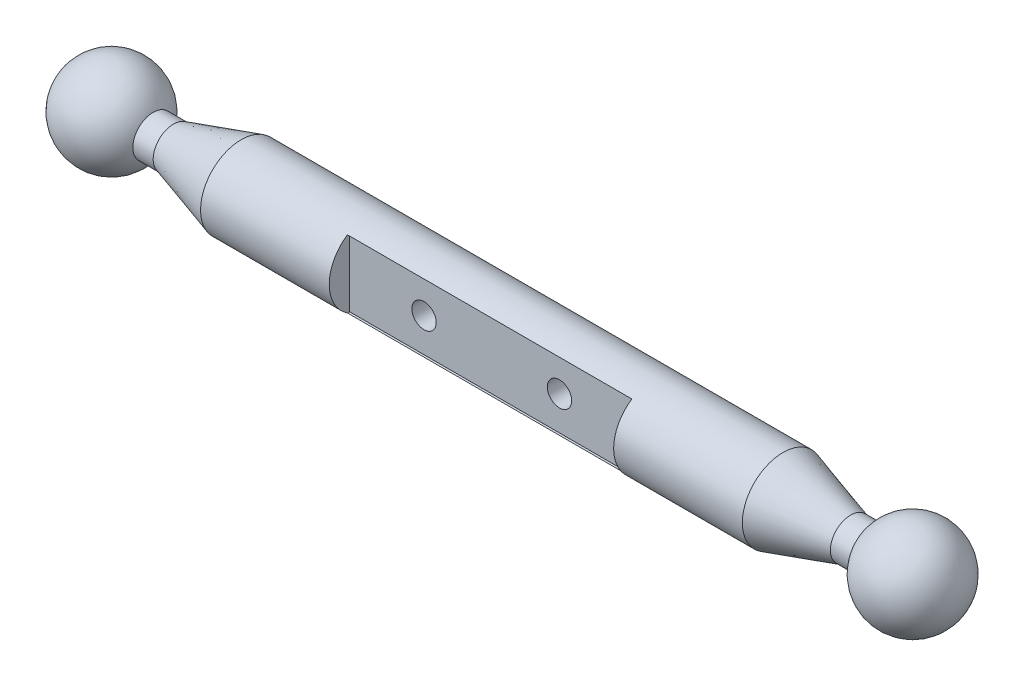
ISO-10303-21;
HEADER;
FILE_DESCRIPTION(('STEP AP214'),'2;1');
FILE_NAME('part.step','',(''),(''),'','','');
FILE_SCHEMA(('AUTOMOTIVE_DESIGN { 1 0 10303 214 1 1 1 1 }'));
ENDSEC;
DATA;
#1=APPLICATION_CONTEXT('core data for automotive mechanical design processes');
#2=APPLICATION_PROTOCOL_DEFINITION('international standard','automotive_design',2000,#1);
#3=PRODUCT_CONTEXT('',#1,'mechanical');
#4=PRODUCT('Part','Part','',(#3));
#5=PRODUCT_RELATED_PRODUCT_CATEGORY('part','',(#4));
#6=PRODUCT_DEFINITION_FORMATION('','',#4);
#7=PRODUCT_DEFINITION_CONTEXT('part definition',#1,'design');
#8=PRODUCT_DEFINITION('design','',#6,#7);
#9=PRODUCT_DEFINITION_SHAPE('','',#8);
#10=(LENGTH_UNIT() NAMED_UNIT(*) SI_UNIT(.MILLI.,.METRE.));
#11=(NAMED_UNIT(*) PLANE_ANGLE_UNIT() SI_UNIT($,.RADIAN.));
#12=(NAMED_UNIT(*) SI_UNIT($,.STERADIAN.) SOLID_ANGLE_UNIT());
#13=UNCERTAINTY_MEASURE_WITH_UNIT(LENGTH_MEASURE(1.E-05),#10,'distance_accuracy_value','');
#14=(GEOMETRIC_REPRESENTATION_CONTEXT(3) GLOBAL_UNCERTAINTY_ASSIGNED_CONTEXT((#13)) GLOBAL_UNIT_ASSIGNED_CONTEXT((#10,
#11,#12)) REPRESENTATION_CONTEXT('',''));
#15=CARTESIAN_POINT('',(0.,0.,0.));
#16=DIRECTION('',(0.,0.,1.));
#17=DIRECTION('',(1.,0.,0.));
#18=AXIS2_PLACEMENT_3D('',#15,#16,#17);
#19=CARTESIAN_POINT('',(295.769230769231,0.,0.));
#20=DIRECTION('',(0.,0.,1.));
#21=DIRECTION('',(1.,0.,0.));
#22=AXIS2_PLACEMENT_3D('',#19,#20,#21);
#23=SPHERICAL_SURFACE('',#22,34.2307692307692);
#24=CARTESIAN_POINT('',(295.769230769231,0.,0.));
#25=DIRECTION('',(-1.,0.,0.));
#26=DIRECTION('',(0.,0.,1.));
#27=AXIS2_PLACEMENT_3D('',#24,#25,#26);
#28=SPHERICAL_SURFACE('',#27,34.2307692307692);
#29=CARTESIAN_POINT('',(265.,0.,0.));
#30=DIRECTION('',(-1.,0.,0.));
#31=DIRECTION('',(0.,0.,1.));
#32=AXIS2_PLACEMENT_3D('',#29,#30,#31);
#33=CIRCLE('',#32,15.);
#34=CARTESIAN_POINT('',(265.,0.,15.));
#35=VERTEX_POINT('',#34);
#36=EDGE_CURVE('E147',#35,#35,#33,.T.);
#37=ORIENTED_EDGE('',*,*,#36,.F.);
#38=EDGE_LOOP('',(#37));
#39=FACE_BOUND('',#38,.T.);
#40=ADVANCED_FACE('F39',(#39),#28,.T.);
#41=CARTESIAN_POINT('',(-265.,0.,0.));
#42=DIRECTION('',(-1.,0.,0.));
#43=DIRECTION('',(0.,0.,1.));
#44=AXIS2_PLACEMENT_3D('',#41,#42,#43);
#45=CYLINDRICAL_SURFACE('',#44,15.);
#46=CARTESIAN_POINT('',(250.,0.,0.));
#47=DIRECTION('',(-1.,0.,0.));
#48=DIRECTION('',(0.,0.,1.));
#49=AXIS2_PLACEMENT_3D('',#46,#47,#48);
#50=CIRCLE('',#49,15.);
#51=CARTESIAN_POINT('',(250.,0.,15.));
#52=VERTEX_POINT('',#51);
#53=EDGE_CURVE('E143',#52,#52,#50,.T.);
#54=ORIENTED_EDGE('',*,*,#53,.F.);
#55=EDGE_LOOP('',(#54));
#56=FACE_BOUND('',#55,.T.);
#57=ORIENTED_EDGE('',*,*,#36,.T.);
#58=EDGE_LOOP('',(#57));
#59=FACE_BOUND('',#58,.T.);
#60=ADVANCED_FACE('F166',(#56,#59),#45,.T.);
#61=CARTESIAN_POINT('',(250.,0.,0.));
#62=DIRECTION('',(-1.,0.,0.));
#63=DIRECTION('',(0.,0.,1.));
#64=AXIS2_PLACEMENT_3D('',#61,#62,#63);
#65=CONICAL_SURFACE('',#64,15.,0.291456794477867);
#66=CARTESIAN_POINT('',(200.,0.,0.));
#67=DIRECTION('',(-1.,0.,0.));
#68=DIRECTION('',(0.,0.,1.));
#69=AXIS2_PLACEMENT_3D('',#66,#67,#68);
#70=CIRCLE('',#69,30.);
#71=CARTESIAN_POINT('',(200.,0.,30.));
#72=VERTEX_POINT('',#71);
#73=EDGE_CURVE('E139',#72,#72,#70,.T.);
#74=ORIENTED_EDGE('',*,*,#73,.F.);
#75=EDGE_LOOP('',(#74));
#76=FACE_BOUND('',#75,.T.);
#77=ORIENTED_EDGE('',*,*,#53,.T.);
#78=EDGE_LOOP('',(#77));
#79=FACE_BOUND('',#78,.T.);
#80=ADVANCED_FACE('F172',(#76,#79),#65,.T.);
#81=CARTESIAN_POINT('',(-265.,0.,0.));
#82=DIRECTION('',(-1.,0.,0.));
#83=DIRECTION('',(0.,0.,1.));
#84=AXIS2_PLACEMENT_3D('',#81,#82,#83);
#85=CYLINDRICAL_SURFACE('',#84,30.);
#86=CARTESIAN_POINT('',(59.,0.,-30.));
#87=CARTESIAN_POINT('',(58.9999995192663,0.24687522719446,-29.9999996908044));
#88=CARTESIAN_POINT('',(58.9898337374895,0.493758933697373,-29.9969453762635));
#89=CARTESIAN_POINT('',(58.949262166763,0.985713316335449,-29.984811532503));
#90=CARTESIAN_POINT('',(58.9188554543427,1.23078390923342,-29.975731728377));
#91=CARTESIAN_POINT('',(58.8380745653432,1.71734028727223,-29.9517958675245));
#92=CARTESIAN_POINT('',(58.7876990206355,1.95882582561324,-29.9369394150227));
#93=CARTESIAN_POINT('',(58.6674006880664,2.43656882894963,-29.9018482217892));
#94=CARTESIAN_POINT('',(58.5974706692544,2.67282432501112,-29.8816114916483));
#95=CARTESIAN_POINT('',(58.438809233375,3.13795593973208,-29.836349231097));
#96=CARTESIAN_POINT('',(58.3501134504766,3.36684511034698,-29.8113327854601));
#97=CARTESIAN_POINT('',(58.1545090861489,3.81629034248756,-29.7571367691595));
#98=CARTESIAN_POINT('',(58.0475936578816,4.03684323307769,-29.7279556341019));
#99=CARTESIAN_POINT('',(57.8164081053077,4.46806405999108,-29.6662069742973));
#100=CARTESIAN_POINT('',(57.6921435122813,4.67873511836349,-29.6336405297005));
#101=CARTESIAN_POINT('',(57.4270444928224,5.08907702569748,-29.5659358702645));
#102=CARTESIAN_POINT('',(57.2862024720026,5.28874277096538,-29.5307964795248));
#103=CARTESIAN_POINT('',(56.9850746947394,5.68079175811244,-29.4579256487591));
#104=CARTESIAN_POINT('',(56.8243802933719,5.872853126084,-29.4201506763858));
#105=CARTESIAN_POINT('',(56.487708747399,6.24276841718319,-29.3438835164778));
#106=CARTESIAN_POINT('',(56.3117380552037,6.42062827839696,-29.3053916370948));
#107=CARTESIAN_POINT('',(55.945464276371,6.76121495469285,-29.2286925276642));
#108=CARTESIAN_POINT('',(55.7551530973834,6.92393310779205,-29.1904854719092));
#109=CARTESIAN_POINT('',(55.3615437764351,7.23301044029677,-29.1154400363661));
#110=CARTESIAN_POINT('',(55.1582504904821,7.37937568089397,-29.0786011528688));
#111=CARTESIAN_POINT('',(54.7350688557075,7.65798662555216,-29.0064894118543));
#112=CARTESIAN_POINT('',(54.5149067756757,7.78983133985888,-28.9712718751733));
#113=CARTESIAN_POINT('',(54.0637917659879,8.03438843056109,-28.904405819866));
#114=CARTESIAN_POINT('',(53.8328431019744,8.14710828969498,-28.8727559070153));
#115=CARTESIAN_POINT('',(53.3616530704563,8.35256518661361,-28.813991056005));
#116=CARTESIAN_POINT('',(53.1214115343119,8.44530186155834,-28.7868762001916));
#117=CARTESIAN_POINT('',(52.6333685232178,8.6099761042191,-28.7380531219073));
#118=CARTESIAN_POINT('',(52.385567317914,8.68191441283537,-28.7163447068465));
#119=CARTESIAN_POINT('',(51.8912849497748,8.80260979417984,-28.6795734086749));
#120=CARTESIAN_POINT('',(51.6449610085294,8.85195939944504,-28.6643415104473));
#121=CARTESIAN_POINT('',(51.148746350119,8.92991899386314,-28.640150467133));
#122=CARTESIAN_POINT('',(50.8988556940309,8.958529337725,-28.6311912147636));
#123=CARTESIAN_POINT('',(50.3974601118256,8.99473123894795,-28.6198387730488));
#124=CARTESIAN_POINT('',(50.1459555362636,9.00232721556963,-28.6174442031708));
#125=CARTESIAN_POINT('',(49.6432208051892,8.99643811389518,-28.6192961531867));
#126=CARTESIAN_POINT('',(49.3919906438751,8.98295349026987,-28.6235425298472));
#127=CARTESIAN_POINT('',(48.9008336962155,8.93590903357945,-28.6382629553569));
#128=CARTESIAN_POINT('',(48.6608279108469,8.90309651768086,-28.6485050902031));
#129=CARTESIAN_POINT('',(48.1844591098566,8.81829693839762,-28.6747206911967));
#130=CARTESIAN_POINT('',(47.9480974234905,8.76630304292881,-28.6906961994197));
#131=CARTESIAN_POINT('',(47.480749416572,8.6435952562788,-28.7279021918085));
#132=CARTESIAN_POINT('',(47.2497623430503,8.57288400473931,-28.7491319349609));
#133=CARTESIAN_POINT('',(46.7946269550669,8.41330748035027,-28.7962353750528));
#134=CARTESIAN_POINT('',(46.5704790190655,8.32444120493493,-28.8221093284476));
#135=CARTESIAN_POINT('',(46.1274335831283,8.12789997921523,-28.8781547204273));
#136=CARTESIAN_POINT('',(45.9086494300025,8.01998497142832,-28.9083799717915));
#137=CARTESIAN_POINT('',(45.4809076890941,7.78698416863509,-28.9720115836062));
#138=CARTESIAN_POINT('',(45.2719503704906,7.66189790363685,-29.0054180311211));
#139=CARTESIAN_POINT('',(44.8650752115418,7.39538391059138,-29.074511931035));
#140=CARTESIAN_POINT('',(44.6671594659432,7.25395309727254,-29.1101998135182));
#141=CARTESIAN_POINT('',(44.2835659462495,6.95567501480213,-29.182908431969));
#142=CARTESIAN_POINT('',(44.0978885236212,6.79882730322163,-29.2199292061682));
#143=CARTESIAN_POINT('',(43.7323708740783,6.46380880146506,-29.2959022608772));
#144=CARTESIAN_POINT('',(43.5530992991263,6.28502066721602,-29.3348705814157));
#145=CARTESIAN_POINT('',(43.2101847118692,5.91290332936832,-29.4121348756642));
#146=CARTESIAN_POINT('',(43.0465417554301,5.71957407379525,-29.4504308469705));
#147=CARTESIAN_POINT('',(42.7359658901512,5.3195794785746,-29.5253022037011));
#148=CARTESIAN_POINT('',(42.5890347056456,5.1129127661993,-29.5618774113479));
#149=CARTESIAN_POINT('',(42.3129502622598,4.6875944702094,-29.6322950882592));
#150=CARTESIAN_POINT('',(42.183796239992,4.46894340179161,-29.6661376748422));
#151=CARTESIAN_POINT('',(41.9433966998228,4.01951930468406,-29.7303774016382));
#152=CARTESIAN_POINT('',(41.8322823535362,3.78867237370753,-29.7607488680959));
#153=CARTESIAN_POINT('',(41.630010572923,3.31796148225631,-29.8168958927951));
#154=CARTESIAN_POINT('',(41.5388450621314,3.0781012171682,-29.8426733101916));
#155=CARTESIAN_POINT('',(41.3772087277255,2.59100646332482,-29.8889030810171));
#156=CARTESIAN_POINT('',(41.3067375067721,2.3437721162555,-29.9093555366869));
#157=CARTESIAN_POINT('',(41.1871386385981,1.8437841623914,-29.9443358483416));
#158=CARTESIAN_POINT('',(41.138010211948,1.59103075750433,-29.9588639206812));
#159=CARTESIAN_POINT('',(41.0629386125718,1.09110687447903,-29.9811579409966));
#160=CARTESIAN_POINT('',(41.0362265876865,0.844061604560796,-29.9891478725817));
#161=CARTESIAN_POINT('',(41.0033217346765,0.348488409261127,-29.9989994939179));
#162=CARTESIAN_POINT('',(40.9971284152396,0.0999605195231696,-30.0008613304037));
#163=CARTESIAN_POINT('',(41.0053176037025,-0.396693900528408,-29.9984049092855));
#164=CARTESIAN_POINT('',(41.0196976281217,-0.644820475666569,-29.9940873976123));
#165=CARTESIAN_POINT('',(41.0688954108604,-1.13885569360232,-29.9793942365501));
#166=CARTESIAN_POINT('',(41.1037130246237,-1.38476435207485,-29.9690186300104));
#167=CARTESIAN_POINT('',(41.1924421677717,-1.86699068629301,-29.9428009027874));
#168=CARTESIAN_POINT('',(41.2458998796666,-2.10339917366125,-29.9270889204468));
#169=CARTESIAN_POINT('',(41.3715984982906,-2.5708534262223,-29.8905620083731));
#170=CARTESIAN_POINT('',(41.4438461357044,-2.80189723737997,-29.8697452502259));
#171=CARTESIAN_POINT('',(41.6065108844607,-3.25694777313325,-29.8235575330009));
#172=CARTESIAN_POINT('',(41.6969228196916,-3.4809564814769,-29.7981878715411));
#173=CARTESIAN_POINT('',(41.8952780246177,-3.9206735334169,-29.7435275314969));
#174=CARTESIAN_POINT('',(42.0032280138338,-4.13637865624372,-29.7142353507995));
#175=CARTESIAN_POINT('',(42.2385066958226,-4.5628802169055,-29.6517727567512));
#176=CARTESIAN_POINT('',(42.3662198675666,-4.77345386566451,-29.6185293648857));
#177=CARTESIAN_POINT('',(42.6383113504956,-5.18324820003159,-29.5495708580577));
#178=CARTESIAN_POINT('',(42.7826971389585,-5.38246373149598,-29.513854636987));
#179=CARTESIAN_POINT('',(43.0871309032109,-5.76824209562065,-29.4408886800085));
#180=CARTESIAN_POINT('',(43.2471788632501,-5.95480494100446,-29.4036389456429));
#181=CARTESIAN_POINT('',(43.5819283548985,-6.31416336644097,-29.3285704174924));
#182=CARTESIAN_POINT('',(43.7566301686524,-6.48695868128923,-29.2907516127623));
#183=CARTESIAN_POINT('',(44.1262666482755,-6.82378475322264,-29.2141554298413));
#184=CARTESIAN_POINT('',(44.3217075440941,-6.98726403029261,-29.1753935631618));
#185=CARTESIAN_POINT('',(44.7258613805791,-7.29714192683923,-29.0994358784767));
#186=CARTESIAN_POINT('',(44.9345694569448,-7.44354675134785,-29.0622394947188));
#187=CARTESIAN_POINT('',(45.3640652823454,-7.71836315758024,-28.9904649037997));
#188=CARTESIAN_POINT('',(45.5848577579616,-7.84676762786344,-28.9558877338828));
#189=CARTESIAN_POINT('',(46.0368992630623,-8.08449235365032,-28.8904168620313));
#190=CARTESIAN_POINT('',(46.2681439308399,-8.19382047882574,-28.8595216428362));
#191=CARTESIAN_POINT('',(46.7385371926035,-8.39212213615004,-28.8024806438489));
#192=CARTESIAN_POINT('',(46.9776457057981,-8.48118472093345,-28.7763141931856));
#193=CARTESIAN_POINT('',(47.4630518161847,-8.63880815166785,-28.7293885157136));
#194=CARTESIAN_POINT('',(47.7093494180245,-8.70736898436385,-28.7086292924009));
#195=CARTESIAN_POINT('',(48.2072347226163,-8.82333878587885,-28.6731995828697));
#196=CARTESIAN_POINT('',(48.4588208847163,-8.8707538278203,-28.6585273485378));
#197=CARTESIAN_POINT('',(48.965407725818,-8.94399853503101,-28.6357533281231));
#198=CARTESIAN_POINT('',(49.2204082743396,-8.96982902277118,-28.6276512916859));
#199=CARTESIAN_POINT('',(49.7211344613679,-8.99902686177177,-28.6184858636405));
#200=CARTESIAN_POINT('',(49.9668034039827,-9.00328608012112,-28.6171430269501));
#201=CARTESIAN_POINT('',(50.4576155661757,-8.99170957250374,-28.6207826121306));
#202=CARTESIAN_POINT('',(50.7027588009065,-8.97587443373627,-28.6257648491696));
#203=CARTESIAN_POINT('',(51.1907161868287,-8.92425831634993,-28.6418983433307));
#204=CARTESIAN_POINT('',(51.4335304432754,-8.88847824348013,-28.6530493203148));
#205=CARTESIAN_POINT('',(51.9151010621588,-8.79729759590077,-28.6811754757235));
#206=CARTESIAN_POINT('',(52.1538574057496,-8.74189693009455,-28.6981506811894));
#207=CARTESIAN_POINT('',(52.6226633672994,-8.61278136684696,-28.7371619944993));
#208=CARTESIAN_POINT('',(52.8527849278569,-8.53930707566764,-28.7591313471678));
#209=CARTESIAN_POINT('',(53.3060392714114,-8.37426393967972,-28.8076222134893));
#210=CARTESIAN_POINT('',(53.5291695207128,-8.28268862083897,-28.8341453554081));
#211=CARTESIAN_POINT('',(53.9669532836628,-8.08215610506225,-28.890995244476));
#212=CARTESIAN_POINT('',(54.1816072512342,-7.97319984049175,-28.9213217875808));
#213=CARTESIAN_POINT('',(54.6011787310789,-7.73866416062295,-28.9849587838462));
#214=CARTESIAN_POINT('',(54.8060956621976,-7.6130837548026,-29.0182694147705));
#215=CARTESIAN_POINT('',(55.2122641594683,-7.34126486815789,-29.088248997366));
#216=CARTESIAN_POINT('',(55.4131104100508,-7.19444058113146,-29.1249960762039));
#217=CARTESIAN_POINT('',(55.8018281874227,-6.8848048622528,-29.1997400804732));
#218=CARTESIAN_POINT('',(55.9896994403252,-6.72199309309909,-29.237737032263));
#219=CARTESIAN_POINT('',(56.3513603937697,-6.38137449598392,-29.3139645469731));
#220=CARTESIAN_POINT('',(56.5251464817687,-6.20356384484473,-29.3521951671376));
#221=CARTESIAN_POINT('',(56.8574895356109,-5.83408763816121,-29.4278605216548));
#222=CARTESIAN_POINT('',(57.0160467690642,-5.64242232618264,-29.465295269984));
#223=CARTESIAN_POINT('',(57.3213452270685,-5.24055724419364,-29.5394569988147));
#224=CARTESIAN_POINT('',(57.467599777415,-5.02997746430739,-29.5761305063874));
#225=CARTESIAN_POINT('',(57.741757225868,-4.59683195296546,-29.6465386369227));
#226=CARTESIAN_POINT('',(57.8696667799763,-4.37427060922233,-29.6802743240427));
#227=CARTESIAN_POINT('',(58.1061800827397,-3.91863702485826,-29.7438595202232));
#228=CARTESIAN_POINT('',(58.2147876911611,-3.68556689736799,-29.7737098059185));
#229=CARTESIAN_POINT('',(58.4118183203768,-3.21051695796146,-29.8286729271997));
#230=CARTESIAN_POINT('',(58.5002432889756,-2.96853800844563,-29.853786219907));
#231=CARTESIAN_POINT('',(58.6477609044286,-2.50382115734949,-29.8961424947304));
#232=CARTESIAN_POINT('',(58.708983724957,-2.28180743967458,-29.9139410348257));
#233=CARTESIAN_POINT('',(58.8143018841147,-1.83334279623096,-29.9447721031423));
#234=CARTESIAN_POINT('',(58.8583916635245,-1.60689045524054,-29.9578030843364));
#235=CARTESIAN_POINT('',(58.9290665485835,-1.15106718653289,-29.97877731236));
#236=CARTESIAN_POINT('',(58.9556540259619,-0.921696658553536,-29.9867212485287));
#237=CARTESIAN_POINT('',(58.9911178490915,-0.461552874118431,-29.9973318050471));
#238=CARTESIAN_POINT('',(59.0000004493921,-0.230780141923343,-30.0000002890375));
#239=CARTESIAN_POINT('',(59.,0.,-30.));
#240=B_SPLINE_CURVE_WITH_KNOTS('',3,(#86,#87,#88,#89,#90,#91,#92,#93,#94,#95,#96,#97,#98,#99,
#100,#101,#102,#103,#104,#105,#106,#107,#108,#109,#110,#111,#112,#113,#114,#115,#116,#117,#118,
#119,#120,#121,#122,#123,#124,#125,#126,#127,#128,#129,#130,#131,#132,#133,#134,#135,#136,#137,
#138,#139,#140,#141,#142,#143,#144,#145,#146,#147,#148,#149,#150,#151,#152,#153,#154,#155,#156,
#157,#158,#159,#160,#161,#162,#163,#164,#165,#166,#167,#168,#169,#170,#171,#172,#173,#174,#175,
#176,#177,#178,#179,#180,#181,#182,#183,#184,#185,#186,#187,#188,#189,#190,#191,#192,#193,#194,
#195,#196,#197,#198,#199,#200,#201,#202,#203,#204,#205,#206,#207,#208,#209,#210,#211,#212,#213,
#214,#215,#216,#217,#218,#219,#220,#221,#222,#223,#224,#225,#226,#227,#228,#229,#230,#231,#232,
#233,#234,#235,#236,#237,#238,#239),.UNSPECIFIED.,.T.,.F.,(4,2,2,2,2,2,2,2,2,2,2,2,2,2,2,2,2,2,
2,2,2,2,2,2,2,2,2,2,2,2,2,2,2,2,2,2,2,2,2,2,2,2,2,2,2,2,2,2,2,2,2,2,2,2,2,2,2,2,2,2,2,2,2,2,2,2,
2,2,2,2,2,2,2,2,2,2,4),(0.,0.740413216901877,1.4808602166743,2.22135795560235,2.96212988240107,
3.70150758898388,4.44116376467172,5.18058465858264,5.92034562132777,6.6792378099229,
7.4378110023569,8.1968155110857,8.95553775562748,9.73166741230635,10.507492698835,
11.2833320710434,12.0591438021185,12.8132385740861,13.5673204482712,14.3212437291631,
15.0751507495034,15.8016616365828,16.5284315448307,17.2550990138762,17.9818066221682,
18.7184283271017,19.4550701980193,20.1918513486502,20.9286536493539,21.6962623628207,
22.4638738200863,23.2315644084216,23.9992220202666,24.7722331237349,25.5449306852944,
26.3176134097618,27.0902679138193,27.8351912450429,28.5800967392512,29.32491232089,
30.0697226344752,30.797537709847,31.5256138536762,32.2534828179172,32.9816313180365,
33.7263192489374,34.4713424616101,35.2163649250774,35.9614017364707,36.7336800097588,
37.5056767488154,38.2779776279686,39.0499591483442,39.8184798678771,40.5870010842807,
41.3553014371578,42.1235725129188,42.8598040112379,43.5960139958236,44.3321905500059,
45.0683705222341,45.7952353579564,46.5223606368482,47.2494469236927,47.9765765522916,
48.7301889381115,49.483817226949,50.2376381976291,50.9914459193129,51.7674951526374,
52.5432621006114,53.3188737452505,54.0944105047804,54.7866663836971,55.4791466941858,
56.1715331476467,56.8636749604174),.UNSPECIFIED.);
#241=CARTESIAN_POINT('',(59.,0.,-30.));
#242=VERTEX_POINT('',#241);
#243=EDGE_CURVE('E106',#242,#242,#240,.T.);
#244=ORIENTED_EDGE('',*,*,#243,.T.);
#245=EDGE_LOOP('',(#244));
#246=FACE_BOUND('',#245,.T.);
#247=CARTESIAN_POINT('',(-41.,0.,-30.));
#248=CARTESIAN_POINT('',(-41.0000004807337,0.24687522719446,-29.9999996908044));
#249=CARTESIAN_POINT('',(-41.0101662625105,0.493758933697374,-29.9969453762635));
#250=CARTESIAN_POINT('',(-41.050737833237,0.98571331633545,-29.984811532503));
#251=CARTESIAN_POINT('',(-41.0811445456573,1.23078390923342,-29.975731728377));
#252=CARTESIAN_POINT('',(-41.1619254346568,1.71734028727224,-29.9517958675245));
#253=CARTESIAN_POINT('',(-41.2123009793645,1.95882582561324,-29.9369394150227));
#254=CARTESIAN_POINT('',(-41.3325993119336,2.43656882894963,-29.9018482217893));
#255=CARTESIAN_POINT('',(-41.4025293307456,2.67282432501112,-29.8816114916483));
#256=CARTESIAN_POINT('',(-41.561190766625,3.13795593973208,-29.836349231097));
#257=CARTESIAN_POINT('',(-41.6498865495234,3.36684511034698,-29.8113327854601));
#258=CARTESIAN_POINT('',(-41.8454909138511,3.81629034248756,-29.7571367691595));
#259=CARTESIAN_POINT('',(-41.9524063421184,4.0368432330777,-29.7279556341019));
#260=CARTESIAN_POINT('',(-42.1835918946923,4.46806405999109,-29.6662069742973));
#261=CARTESIAN_POINT('',(-42.3078564877187,4.6787351183635,-29.6336405297005));
#262=CARTESIAN_POINT('',(-42.5729555071776,5.08907702569748,-29.5659358702645));
#263=CARTESIAN_POINT('',(-42.7137975279974,5.28874277096538,-29.5307964795248));
#264=CARTESIAN_POINT('',(-43.0149253052606,5.68079175811244,-29.4579256487591));
#265=CARTESIAN_POINT('',(-43.1756197066281,5.872853126084,-29.4201506763858));
#266=CARTESIAN_POINT('',(-43.512291252601,6.2427684171832,-29.3438835164778));
#267=CARTESIAN_POINT('',(-43.6882619447963,6.42062827839697,-29.3053916370948));
#268=CARTESIAN_POINT('',(-44.054535723629,6.76121495469286,-29.2286925276642));
#269=CARTESIAN_POINT('',(-44.2448469026166,6.92393310779205,-29.1904854719092));
#270=CARTESIAN_POINT('',(-44.6384562235649,7.23301044029677,-29.1154400363661));
#271=CARTESIAN_POINT('',(-44.8417495095179,7.37937568089397,-29.0786011528688));
#272=CARTESIAN_POINT('',(-45.2649311442925,7.65798662555216,-29.0064894118543));
#273=CARTESIAN_POINT('',(-45.4850932243243,7.78983133985888,-28.9712718751733));
#274=CARTESIAN_POINT('',(-45.9362082340121,8.03438843056109,-28.904405819866));
#275=CARTESIAN_POINT('',(-46.1671568980256,8.14710828969498,-28.8727559070153));
#276=CARTESIAN_POINT('',(-46.6383469295437,8.35256518661361,-28.813991056005));
#277=CARTESIAN_POINT('',(-46.8785884656881,8.44530186155834,-28.7868762001916));
#278=CARTESIAN_POINT('',(-47.3666314767822,8.6099761042191,-28.7380531219073));
#279=CARTESIAN_POINT('',(-47.614432682086,8.68191441283537,-28.7163447068465));
#280=CARTESIAN_POINT('',(-48.1087150502252,8.80260979417984,-28.6795734086749));
#281=CARTESIAN_POINT('',(-48.3550389914706,8.85195939944505,-28.6643415104473));
#282=CARTESIAN_POINT('',(-48.851253649881,8.92991899386314,-28.640150467133));
#283=CARTESIAN_POINT('',(-49.1011443059691,8.958529337725,-28.6311912147636));
#284=CARTESIAN_POINT('',(-49.6025398881744,8.99473123894795,-28.6198387730488));
#285=CARTESIAN_POINT('',(-49.8540444637364,9.00232721556963,-28.6174442031708));
#286=CARTESIAN_POINT('',(-50.3567791948108,8.99643811389518,-28.6192961531867));
#287=CARTESIAN_POINT('',(-50.608009356125,8.98295349026987,-28.6235425298472));
#288=CARTESIAN_POINT('',(-51.0991663037845,8.93590903357945,-28.6382629553569));
#289=CARTESIAN_POINT('',(-51.3391720891531,8.90309651768086,-28.6485050902031));
#290=CARTESIAN_POINT('',(-51.8155408901434,8.81829693839762,-28.6747206911967));
#291=CARTESIAN_POINT('',(-52.0519025765095,8.76630304292881,-28.6906961994197));
#292=CARTESIAN_POINT('',(-52.519250583428,8.6435952562788,-28.7279021918085));
#293=CARTESIAN_POINT('',(-52.7502376569497,8.57288400473931,-28.7491319349609));
#294=CARTESIAN_POINT('',(-53.2053730449331,8.41330748035028,-28.7962353750528));
#295=CARTESIAN_POINT('',(-53.4295209809345,8.32444120493493,-28.8221093284476));
#296=CARTESIAN_POINT('',(-53.8725664168717,8.12789997921523,-28.8781547204273));
#297=CARTESIAN_POINT('',(-54.0913505699975,8.01998497142832,-28.9083799717915));
#298=CARTESIAN_POINT('',(-54.5190923109059,7.78698416863509,-28.9720115836062));
#299=CARTESIAN_POINT('',(-54.7280496295094,7.66189790363685,-29.0054180311211));
#300=CARTESIAN_POINT('',(-55.1349247884582,7.39538391059137,-29.074511931035));
#301=CARTESIAN_POINT('',(-55.3328405340568,7.25395309727253,-29.1101998135182));
#302=CARTESIAN_POINT('',(-55.7164340537505,6.95567501480212,-29.182908431969));
#303=CARTESIAN_POINT('',(-55.9021114763788,6.79882730322163,-29.2199292061682));
#304=CARTESIAN_POINT('',(-56.2676291259217,6.46380880146506,-29.2959022608772));
#305=CARTESIAN_POINT('',(-56.4469007008737,6.28502066721602,-29.3348705814157));
#306=CARTESIAN_POINT('',(-56.7898152881308,5.91290332936832,-29.4121348756642));
#307=CARTESIAN_POINT('',(-56.9534582445699,5.71957407379525,-29.4504308469705));
#308=CARTESIAN_POINT('',(-57.2640341098488,5.3195794785746,-29.5253022037011));
#309=CARTESIAN_POINT('',(-57.4109652943544,5.1129127661993,-29.5618774113479));
#310=CARTESIAN_POINT('',(-57.6870497377402,4.6875944702094,-29.6322950882592));
#311=CARTESIAN_POINT('',(-57.816203760008,4.46894340179161,-29.6661376748422));
#312=CARTESIAN_POINT('',(-58.0566033001772,4.01951930468406,-29.7303774016382));
#313=CARTESIAN_POINT('',(-58.1677176464638,3.78867237370753,-29.7607488680959));
#314=CARTESIAN_POINT('',(-58.369989427077,3.31796148225631,-29.8168958927951));
#315=CARTESIAN_POINT('',(-58.4611549378686,3.0781012171682,-29.8426733101916));
#316=CARTESIAN_POINT('',(-58.6227912722745,2.59100646332482,-29.8889030810171));
#317=CARTESIAN_POINT('',(-58.6932624932279,2.34377211625549,-29.9093555366869));
#318=CARTESIAN_POINT('',(-58.8128613614019,1.8437841623914,-29.9443358483416));
#319=CARTESIAN_POINT('',(-58.8619897880521,1.59103075750433,-29.9588639206812));
#320=CARTESIAN_POINT('',(-58.9370613874282,1.09110687447903,-29.9811579409966));
#321=CARTESIAN_POINT('',(-58.9637734123135,0.844061604560799,-29.9891478725817));
#322=CARTESIAN_POINT('',(-58.9966782653235,0.348488409261129,-29.9989994939179));
#323=CARTESIAN_POINT('',(-59.0028715847604,0.0999605195231709,-30.0008613304037));
#324=CARTESIAN_POINT('',(-58.9946823962975,-0.396693900528407,-29.9984049092855));
#325=CARTESIAN_POINT('',(-58.9803023718783,-0.644820475666569,-29.9940873976123));
#326=CARTESIAN_POINT('',(-58.9311045891396,-1.13885569360232,-29.9793942365501));
#327=CARTESIAN_POINT('',(-58.8962869753763,-1.38476435207485,-29.9690186300104));
#328=CARTESIAN_POINT('',(-58.8075578322283,-1.86699068629301,-29.9428009027874));
#329=CARTESIAN_POINT('',(-58.7541001203335,-2.10339917366125,-29.9270889204468));
#330=CARTESIAN_POINT('',(-58.6284015017094,-2.5708534262223,-29.8905620083731));
#331=CARTESIAN_POINT('',(-58.5561538642956,-2.80189723737997,-29.8697452502259));
#332=CARTESIAN_POINT('',(-58.3934891155393,-3.25694777313325,-29.8235575330009));
#333=CARTESIAN_POINT('',(-58.3030771803084,-3.4809564814769,-29.7981878715411));
#334=CARTESIAN_POINT('',(-58.1047219753823,-3.9206735334169,-29.7435275314969));
#335=CARTESIAN_POINT('',(-57.9967719861662,-4.13637865624372,-29.7142353507995));
#336=CARTESIAN_POINT('',(-57.7614933041774,-4.5628802169055,-29.6517727567512));
#337=CARTESIAN_POINT('',(-57.6337801324334,-4.77345386566451,-29.6185293648857));
#338=CARTESIAN_POINT('',(-57.3616886495044,-5.18324820003159,-29.5495708580577));
#339=CARTESIAN_POINT('',(-57.2173028610415,-5.38246373149597,-29.513854636987));
#340=CARTESIAN_POINT('',(-56.9128690967891,-5.76824209562064,-29.4408886800085));
#341=CARTESIAN_POINT('',(-56.7528211367499,-5.95480494100446,-29.4036389456429));
#342=CARTESIAN_POINT('',(-56.4180716451015,-6.31416336644096,-29.3285704174924));
#343=CARTESIAN_POINT('',(-56.2433698313476,-6.48695868128923,-29.2907516127623));
#344=CARTESIAN_POINT('',(-55.8737333517245,-6.82378475322264,-29.2141554298413));
#345=CARTESIAN_POINT('',(-55.6782924559059,-6.98726403029261,-29.1753935631618));
#346=CARTESIAN_POINT('',(-55.2741386194209,-7.29714192683923,-29.0994358784767));
#347=CARTESIAN_POINT('',(-55.0654305430552,-7.44354675134785,-29.0622394947188));
#348=CARTESIAN_POINT('',(-54.6359347176546,-7.71836315758024,-28.9904649037997));
#349=CARTESIAN_POINT('',(-54.4151422420384,-7.84676762786344,-28.9558877338828));
#350=CARTESIAN_POINT('',(-53.9631007369377,-8.08449235365032,-28.8904168620313));
#351=CARTESIAN_POINT('',(-53.7318560691601,-8.19382047882574,-28.8595216428362));
#352=CARTESIAN_POINT('',(-53.2614628073965,-8.39212213615004,-28.8024806438489));
#353=CARTESIAN_POINT('',(-53.0223542942019,-8.48118472093345,-28.7763141931856));
#354=CARTESIAN_POINT('',(-52.5369481838153,-8.63880815166785,-28.7293885157136));
#355=CARTESIAN_POINT('',(-52.2906505819755,-8.70736898436385,-28.7086292924009));
#356=CARTESIAN_POINT('',(-51.7927652773837,-8.82333878587885,-28.6731995828697));
#357=CARTESIAN_POINT('',(-51.5411791152837,-8.8707538278203,-28.6585273485378));
#358=CARTESIAN_POINT('',(-51.034592274182,-8.94399853503101,-28.6357533281231));
#359=CARTESIAN_POINT('',(-50.7795917256604,-8.96982902277118,-28.6276512916859));
#360=CARTESIAN_POINT('',(-50.2788655386321,-8.99902686177177,-28.6184858636405));
#361=CARTESIAN_POINT('',(-50.0331965960173,-9.00328608012112,-28.6171430269501));
#362=CARTESIAN_POINT('',(-49.5423844338243,-8.99170957250374,-28.6207826121306));
#363=CARTESIAN_POINT('',(-49.2972411990935,-8.97587443373627,-28.6257648491696));
#364=CARTESIAN_POINT('',(-48.8092838131713,-8.92425831634993,-28.6418983433307));
#365=CARTESIAN_POINT('',(-48.5664695567246,-8.88847824348014,-28.6530493203148));
#366=CARTESIAN_POINT('',(-48.0848989378412,-8.79729759590077,-28.6811754757235));
#367=CARTESIAN_POINT('',(-47.8461425942505,-8.74189693009455,-28.6981506811894));
#368=CARTESIAN_POINT('',(-47.3773366327006,-8.61278136684696,-28.7371619944993));
#369=CARTESIAN_POINT('',(-47.1472150721431,-8.53930707566764,-28.7591313471678));
#370=CARTESIAN_POINT('',(-46.6939607285886,-8.37426393967972,-28.8076222134893));
#371=CARTESIAN_POINT('',(-46.4708304792872,-8.28268862083897,-28.8341453554081));
#372=CARTESIAN_POINT('',(-46.0330467163372,-8.08215610506225,-28.890995244476));
#373=CARTESIAN_POINT('',(-45.8183927487658,-7.97319984049174,-28.9213217875809));
#374=CARTESIAN_POINT('',(-45.3988212689211,-7.73866416062295,-28.9849587838462));
#375=CARTESIAN_POINT('',(-45.1939043378025,-7.6130837548026,-29.0182694147705));
#376=CARTESIAN_POINT('',(-44.7877358405317,-7.34126486815789,-29.088248997366));
#377=CARTESIAN_POINT('',(-44.5868895899492,-7.19444058113146,-29.1249960762039));
#378=CARTESIAN_POINT('',(-44.1981718125773,-6.8848048622528,-29.1997400804732));
#379=CARTESIAN_POINT('',(-44.0103005596748,-6.72199309309909,-29.237737032263));
#380=CARTESIAN_POINT('',(-43.6486396062303,-6.38137449598392,-29.3139645469731));
#381=CARTESIAN_POINT('',(-43.4748535182313,-6.20356384484473,-29.3521951671376));
#382=CARTESIAN_POINT('',(-43.1425104643891,-5.83408763816121,-29.4278605216548));
#383=CARTESIAN_POINT('',(-42.9839532309358,-5.64242232618264,-29.465295269984));
#384=CARTESIAN_POINT('',(-42.6786547729315,-5.24055724419364,-29.5394569988147));
#385=CARTESIAN_POINT('',(-42.532400222585,-5.02997746430739,-29.5761305063874));
#386=CARTESIAN_POINT('',(-42.258242774132,-4.59683195296546,-29.6465386369227));
#387=CARTESIAN_POINT('',(-42.1303332200237,-4.37427060922233,-29.6802743240427));
#388=CARTESIAN_POINT('',(-41.8938199172603,-3.91863702485826,-29.7438595202232));
#389=CARTESIAN_POINT('',(-41.7852123088389,-3.68556689736799,-29.7737098059185));
#390=CARTESIAN_POINT('',(-41.5881816796232,-3.21051695796146,-29.8286729271997));
#391=CARTESIAN_POINT('',(-41.4997567110244,-2.96853800844563,-29.853786219907));
#392=CARTESIAN_POINT('',(-41.3522390955714,-2.50382115734949,-29.8961424947304));
#393=CARTESIAN_POINT('',(-41.291016275043,-2.28180743967458,-29.9139410348257));
#394=CARTESIAN_POINT('',(-41.1856981158853,-1.83334279623096,-29.9447721031423));
#395=CARTESIAN_POINT('',(-41.1416083364755,-1.60689045524054,-29.9578030843364));
#396=CARTESIAN_POINT('',(-41.0709334514165,-1.15106718653289,-29.97877731236));
#397=CARTESIAN_POINT('',(-41.0443459740381,-0.921696658553537,-29.9867212485287));
#398=CARTESIAN_POINT('',(-41.0088821509085,-0.461552874118432,-29.9973318050471));
#399=CARTESIAN_POINT('',(-40.9999995506079,-0.230780141923343,-30.0000002890375));
#400=CARTESIAN_POINT('',(-41.,0.,-30.));
#401=B_SPLINE_CURVE_WITH_KNOTS('',3,(#247,#248,#249,#250,#251,#252,#253,#254,#255,#256,#257,
#258,#259,#260,#261,#262,#263,#264,#265,#266,#267,#268,#269,#270,#271,#272,#273,#274,#275,#276,
#277,#278,#279,#280,#281,#282,#283,#284,#285,#286,#287,#288,#289,#290,#291,#292,#293,#294,#295,
#296,#297,#298,#299,#300,#301,#302,#303,#304,#305,#306,#307,#308,#309,#310,#311,#312,#313,#314,
#315,#316,#317,#318,#319,#320,#321,#322,#323,#324,#325,#326,#327,#328,#329,#330,#331,#332,#333,
#334,#335,#336,#337,#338,#339,#340,#341,#342,#343,#344,#345,#346,#347,#348,#349,#350,#351,#352,
#353,#354,#355,#356,#357,#358,#359,#360,#361,#362,#363,#364,#365,#366,#367,#368,#369,#370,#371,
#372,#373,#374,#375,#376,#377,#378,#379,#380,#381,#382,#383,#384,#385,#386,#387,#388,#389,#390,
#391,#392,#393,#394,#395,#396,#397,#398,#399,#400),.UNSPECIFIED.,.T.,.F.,(4,2,2,2,2,2,2,2,2,2,2,
2,2,2,2,2,2,2,2,2,2,2,2,2,2,2,2,2,2,2,2,2,2,2,2,2,2,2,2,2,2,2,2,2,2,2,2,2,2,2,2,2,2,2,2,2,2,2,2,
2,2,2,2,2,2,2,2,2,2,2,2,2,2,2,2,2,4),(0.,0.740413216901878,1.4808602166743,2.22135795560235,
2.96212988240107,3.70150758898389,4.44116376467174,5.18058465858265,5.92034562132777,
6.67923780992291,7.43781100235692,8.1968155110857,8.95553775562748,9.73166741230635,
10.507492698835,11.2833320710434,12.0591438021185,12.8132385740861,13.5673204482712,
14.3212437291631,15.0751507495034,15.8016616365828,16.5284315448307,17.2550990138762,
17.9818066221682,18.7184283271017,19.4550701980193,20.1918513486502,20.9286536493539,
21.6962623628207,22.4638738200863,23.2315644084216,23.9992220202666,24.7722331237348,
25.5449306852944,26.3176134097618,27.0902679138193,27.8351912450428,28.5800967392512,
29.32491232089,30.0697226344752,30.797537709847,31.5256138536762,32.2534828179172,
32.9816313180365,33.7263192489374,34.4713424616101,35.2163649250774,35.9614017364707,
36.7336800097587,37.5056767488154,38.2779776279686,39.0499591483442,39.8184798678771,
40.5870010842807,41.3553014371578,42.1235725129188,42.8598040112379,43.5960139958236,
44.3321905500058,45.0683705222341,45.7952353579563,46.5223606368482,47.2494469236927,
47.9765765522915,48.7301889381115,49.483817226949,50.2376381976291,50.9914459193129,
51.7674951526374,52.5432621006114,53.3188737452505,54.0944105047804,54.7866663836971,
55.4791466941858,56.1715331476467,56.8636749604174),.UNSPECIFIED.);
#402=CARTESIAN_POINT('',(-41.,0.,-30.));
#403=VERTEX_POINT('',#402);
#404=EDGE_CURVE('E159',#403,#403,#401,.T.);
#405=ORIENTED_EDGE('',*,*,#404,.T.);
#406=EDGE_LOOP('',(#405));
#407=FACE_BOUND('',#406,.T.);
#408=CARTESIAN_POINT('',(-105.,0.,0.));
#409=DIRECTION('',(-1.,0.,0.));
#410=DIRECTION('',(0.,0.,1.));
#411=AXIS2_PLACEMENT_3D('',#408,#409,#410);
#412=CIRCLE('',#411,30.);
#413=CARTESIAN_POINT('',(-105.,-25.,16.583123951777));
#414=VERTEX_POINT('',#413);
#415=CARTESIAN_POINT('',(-105.,25.,16.583123951777));
#416=VERTEX_POINT('',#415);
#417=EDGE_CURVE('E148',#414,#416,#412,.T.);
#418=ORIENTED_EDGE('',*,*,#417,.T.);
#419=DIRECTION('',(-1.,0.,0.));
#420=VECTOR('',#419,1.);
#421=CARTESIAN_POINT('',(-265.,25.,16.583123951777));
#422=LINE('',#421,#420);
#423=CARTESIAN_POINT('',(105.,25.,16.583123951777));
#424=VERTEX_POINT('',#423);
#425=EDGE_CURVE('E11',#416,#424,#422,.F.);
#426=ORIENTED_EDGE('',*,*,#425,.T.);
#427=CARTESIAN_POINT('',(105.,0.,0.));
#428=DIRECTION('',(1.,0.,0.));
#429=DIRECTION('',(0.,0.,-1.));
#430=AXIS2_PLACEMENT_3D('',#427,#428,#429);
#431=CIRCLE('',#430,30.);
#432=CARTESIAN_POINT('',(105.,-25.,16.583123951777));
#433=VERTEX_POINT('',#432);
#434=EDGE_CURVE('E49',#424,#433,#431,.T.);
#435=ORIENTED_EDGE('',*,*,#434,.T.);
#436=DIRECTION('',(-1.,0.,0.));
#437=VECTOR('',#436,1.);
#438=CARTESIAN_POINT('',(-265.,-25.,16.583123951777));
#439=LINE('',#438,#437);
#440=EDGE_CURVE('E64',#433,#414,#439,.T.);
#441=ORIENTED_EDGE('',*,*,#440,.T.);
#442=EDGE_LOOP('',(#418,#426,#435,#441));
#443=FACE_BOUND('',#442,.T.);
#444=CARTESIAN_POINT('',(-200.,0.,0.));
#445=DIRECTION('',(-1.,0.,0.));
#446=DIRECTION('',(0.,0.,1.));
#447=AXIS2_PLACEMENT_3D('',#444,#445,#446);
#448=CIRCLE('',#447,30.);
#449=CARTESIAN_POINT('',(-200.,0.,30.));
#450=VERTEX_POINT('',#449);
#451=EDGE_CURVE('E135',#450,#450,#448,.T.);
#452=ORIENTED_EDGE('',*,*,#451,.F.);
#453=EDGE_LOOP('',(#452));
#454=FACE_BOUND('',#453,.T.);
#455=ORIENTED_EDGE('',*,*,#73,.T.);
#456=EDGE_LOOP('',(#455));
#457=FACE_BOUND('',#456,.T.);
#458=ADVANCED_FACE('F177',(#246,#407,#443,#454,#457),#85,.T.);
#459=CARTESIAN_POINT('',(-200.,0.,0.));
#460=DIRECTION('',(1.,0.,0.));
#461=DIRECTION('',(0.,0.,-1.));
#462=AXIS2_PLACEMENT_3D('',#459,#460,#461);
#463=CONICAL_SURFACE('',#462,30.,0.291456794477867);
#464=CARTESIAN_POINT('',(-250.,0.,0.));
#465=DIRECTION('',(-1.,0.,0.));
#466=DIRECTION('',(0.,0.,1.));
#467=AXIS2_PLACEMENT_3D('',#464,#465,#466);
#468=CIRCLE('',#467,15.);
#469=CARTESIAN_POINT('',(-250.,0.,15.));
#470=VERTEX_POINT('',#469);
#471=EDGE_CURVE('E131',#470,#470,#468,.T.);
#472=ORIENTED_EDGE('',*,*,#471,.F.);
#473=EDGE_LOOP('',(#472));
#474=FACE_BOUND('',#473,.T.);
#475=ORIENTED_EDGE('',*,*,#451,.T.);
#476=EDGE_LOOP('',(#475));
#477=FACE_BOUND('',#476,.T.);
#478=ADVANCED_FACE('F182',(#474,#477),#463,.T.);
#479=CARTESIAN_POINT('',(-265.,0.,0.));
#480=DIRECTION('',(-1.,0.,0.));
#481=DIRECTION('',(0.,0.,1.));
#482=AXIS2_PLACEMENT_3D('',#479,#480,#481);
#483=CYLINDRICAL_SURFACE('',#482,15.);
#484=CARTESIAN_POINT('',(-265.,0.,0.));
#485=DIRECTION('',(-1.,0.,0.));
#486=DIRECTION('',(0.,0.,1.));
#487=AXIS2_PLACEMENT_3D('',#484,#485,#486);
#488=CIRCLE('',#487,15.);
#489=CARTESIAN_POINT('',(-265.,0.,15.));
#490=VERTEX_POINT('',#489);
#491=EDGE_CURVE('E43',#490,#490,#488,.T.);
#492=ORIENTED_EDGE('',*,*,#491,.F.);
#493=EDGE_LOOP('',(#492));
#494=FACE_BOUND('',#493,.T.);
#495=ORIENTED_EDGE('',*,*,#471,.T.);
#496=EDGE_LOOP('',(#495));
#497=FACE_BOUND('',#496,.T.);
#498=ADVANCED_FACE('F212',(#494,#497),#483,.T.);
#499=CARTESIAN_POINT('',(-295.769230769231,0.,0.));
#500=DIRECTION('',(0.,0.,1.));
#501=DIRECTION('',(1.,0.,0.));
#502=AXIS2_PLACEMENT_3D('',#499,#500,#501);
#503=SPHERICAL_SURFACE('',#502,34.2307692307692);
#504=CARTESIAN_POINT('',(-295.769230769231,0.,0.));
#505=DIRECTION('',(-1.,0.,0.));
#506=DIRECTION('',(0.,0.,1.));
#507=AXIS2_PLACEMENT_3D('',#504,#505,#506);
#508=SPHERICAL_SURFACE('',#507,34.2307692307692);
#509=ORIENTED_EDGE('',*,*,#491,.T.);
#510=EDGE_LOOP('',(#509));
#511=FACE_BOUND('',#510,.T.);
#512=ADVANCED_FACE('F41',(#511),#508,.T.);
#513=CARTESIAN_POINT('',(105.,-25.,15.));
#514=DIRECTION('',(1.,0.,0.));
#515=DIRECTION('',(0.,0.,-1.));
#516=AXIS2_PLACEMENT_3D('',#513,#514,#515);
#517=PLANE('',#516);
#518=DIRECTION('',(0.,0.,1.));
#519=VECTOR('',#518,1.);
#520=CARTESIAN_POINT('',(105.,25.,15.));
#521=LINE('',#520,#519);
#522=CARTESIAN_POINT('',(105.,25.,15.));
#523=VERTEX_POINT('',#522);
#524=EDGE_CURVE('E81',#523,#424,#521,.T.);
#525=ORIENTED_EDGE('',*,*,#524,.F.);
#526=DIRECTION('',(0.,1.,0.));
#527=VECTOR('',#526,1.);
#528=CARTESIAN_POINT('',(105.,-25.,15.));
#529=LINE('',#528,#527);
#530=CARTESIAN_POINT('',(105.,-25.,15.));
#531=VERTEX_POINT('',#530);
#532=EDGE_CURVE('E85',#531,#523,#529,.T.);
#533=ORIENTED_EDGE('',*,*,#532,.F.);
#534=DIRECTION('',(0.,0.,1.));
#535=VECTOR('',#534,1.);
#536=CARTESIAN_POINT('',(105.,-25.,15.));
#537=LINE('',#536,#535);
#538=EDGE_CURVE('E123',#531,#433,#537,.T.);
#539=ORIENTED_EDGE('',*,*,#538,.T.);
#540=ORIENTED_EDGE('',*,*,#434,.F.);
#541=EDGE_LOOP('',(#525,#533,#539,#540));
#542=FACE_BOUND('',#541,.T.);
#543=ADVANCED_FACE('F83',(#542),#517,.F.);
#544=CARTESIAN_POINT('',(-105.,-25.,15.));
#545=DIRECTION('',(0.,-1.,0.));
#546=DIRECTION('',(0.,0.,-1.));
#547=AXIS2_PLACEMENT_3D('',#544,#545,#546);
#548=PLANE('',#547);
#549=ORIENTED_EDGE('',*,*,#538,.F.);
#550=DIRECTION('',(1.,0.,0.));
#551=VECTOR('',#550,1.);
#552=CARTESIAN_POINT('',(-105.,-25.,15.));
#553=LINE('',#552,#551);
#554=CARTESIAN_POINT('',(-105.,-25.,15.));
#555=VERTEX_POINT('',#554);
#556=EDGE_CURVE('E91',#555,#531,#553,.T.);
#557=ORIENTED_EDGE('',*,*,#556,.F.);
#558=DIRECTION('',(0.,0.,1.));
#559=VECTOR('',#558,1.);
#560=CARTESIAN_POINT('',(-105.,-25.,15.));
#561=LINE('',#560,#559);
#562=EDGE_CURVE('E126',#555,#414,#561,.T.);
#563=ORIENTED_EDGE('',*,*,#562,.T.);
#564=ORIENTED_EDGE('',*,*,#440,.F.);
#565=EDGE_LOOP('',(#549,#557,#563,#564));
#566=FACE_BOUND('',#565,.T.);
#567=ADVANCED_FACE('F202',(#566),#548,.F.);
#568=CARTESIAN_POINT('',(-105.,-25.,15.));
#569=DIRECTION('',(-1.,0.,0.));
#570=DIRECTION('',(0.,0.,1.));
#571=AXIS2_PLACEMENT_3D('',#568,#569,#570);
#572=PLANE('',#571);
#573=ORIENTED_EDGE('',*,*,#417,.F.);
#574=ORIENTED_EDGE('',*,*,#562,.F.);
#575=DIRECTION('',(0.,-1.,0.));
#576=VECTOR('',#575,1.);
#577=CARTESIAN_POINT('',(-105.,-25.,15.));
#578=LINE('',#577,#576);
#579=CARTESIAN_POINT('',(-105.,25.,15.));
#580=VERTEX_POINT('',#579);
#581=EDGE_CURVE('E101',#580,#555,#578,.T.);
#582=ORIENTED_EDGE('',*,*,#581,.F.);
#583=DIRECTION('',(0.,0.,1.));
#584=VECTOR('',#583,1.);
#585=CARTESIAN_POINT('',(-105.,25.,15.));
#586=LINE('',#585,#584);
#587=EDGE_CURVE('E90',#580,#416,#586,.T.);
#588=ORIENTED_EDGE('',*,*,#587,.T.);
#589=EDGE_LOOP('',(#573,#574,#582,#588));
#590=FACE_BOUND('',#589,.T.);
#591=ADVANCED_FACE('F205',(#590),#572,.F.);
#592=CARTESIAN_POINT('',(-105.,25.,15.));
#593=DIRECTION('',(0.,1.,0.));
#594=DIRECTION('',(0.,0.,1.));
#595=AXIS2_PLACEMENT_3D('',#592,#593,#594);
#596=PLANE('',#595);
#597=ORIENTED_EDGE('',*,*,#587,.F.);
#598=DIRECTION('',(-1.,0.,0.));
#599=VECTOR('',#598,1.);
#600=CARTESIAN_POINT('',(-105.,25.,15.));
#601=LINE('',#600,#599);
#602=EDGE_CURVE('E94',#523,#580,#601,.T.);
#603=ORIENTED_EDGE('',*,*,#602,.F.);
#604=ORIENTED_EDGE('',*,*,#524,.T.);
#605=ORIENTED_EDGE('',*,*,#425,.F.);
#606=EDGE_LOOP('',(#597,#603,#604,#605));
#607=FACE_BOUND('',#606,.T.);
#608=ADVANCED_FACE('F95',(#607),#596,.F.);
#609=CARTESIAN_POINT('',(0.,0.,15.));
#610=DIRECTION('',(0.,0.,-1.));
#611=DIRECTION('',(-1.,0.,0.));
#612=AXIS2_PLACEMENT_3D('',#609,#610,#611);
#613=PLANE('',#612);
#614=CARTESIAN_POINT('',(50.,0.,15.));
#615=DIRECTION('',(0.,0.,-1.));
#616=DIRECTION('',(-1.,0.,0.));
#617=AXIS2_PLACEMENT_3D('',#614,#615,#616);
#618=CIRCLE('',#617,9.);
#619=CARTESIAN_POINT('',(41.,0.,15.));
#620=VERTEX_POINT('',#619);
#621=EDGE_CURVE('E110',#620,#620,#618,.T.);
#622=ORIENTED_EDGE('',*,*,#621,.T.);
#623=EDGE_LOOP('',(#622));
#624=FACE_BOUND('',#623,.T.);
#625=CARTESIAN_POINT('',(-50.,0.,15.));
#626=DIRECTION('',(0.,0.,-1.));
#627=DIRECTION('',(-1.,0.,0.));
#628=AXIS2_PLACEMENT_3D('',#625,#626,#627);
#629=CIRCLE('',#628,9.);
#630=CARTESIAN_POINT('',(-59.,0.,15.));
#631=VERTEX_POINT('',#630);
#632=EDGE_CURVE('E155',#631,#631,#629,.T.);
#633=ORIENTED_EDGE('',*,*,#632,.T.);
#634=EDGE_LOOP('',(#633));
#635=FACE_BOUND('',#634,.T.);
#636=ORIENTED_EDGE('',*,*,#532,.T.);
#637=ORIENTED_EDGE('',*,*,#602,.T.);
#638=ORIENTED_EDGE('',*,*,#581,.T.);
#639=ORIENTED_EDGE('',*,*,#556,.T.);
#640=EDGE_LOOP('',(#636,#637,#638,#639));
#641=FACE_BOUND('',#640,.T.);
#642=ADVANCED_FACE('F103',(#624,#635,#641),#613,.F.);
#643=CARTESIAN_POINT('',(-50.,0.,-50.));
#644=DIRECTION('',(0.,0.,1.));
#645=DIRECTION('',(1.,0.,0.));
#646=AXIS2_PLACEMENT_3D('',#643,#644,#645);
#647=CYLINDRICAL_SURFACE('',#646,9.);
#648=ORIENTED_EDGE('',*,*,#632,.F.);
#649=EDGE_LOOP('',(#648));
#650=FACE_BOUND('',#649,.T.);
#651=ORIENTED_EDGE('',*,*,#404,.F.);
#652=EDGE_LOOP('',(#651));
#653=FACE_BOUND('',#652,.T.);
#654=ADVANCED_FACE('F192',(#650,#653),#647,.F.);
#655=CARTESIAN_POINT('',(50.,0.,-50.));
#656=DIRECTION('',(0.,0.,1.));
#657=DIRECTION('',(1.,0.,0.));
#658=AXIS2_PLACEMENT_3D('',#655,#656,#657);
#659=CYLINDRICAL_SURFACE('',#658,9.);
#660=ORIENTED_EDGE('',*,*,#621,.F.);
#661=EDGE_LOOP('',(#660));
#662=FACE_BOUND('',#661,.T.);
#663=ORIENTED_EDGE('',*,*,#243,.F.);
#664=EDGE_LOOP('',(#663));
#665=FACE_BOUND('',#664,.T.);
#666=ADVANCED_FACE('F196',(#662,#665),#659,.F.);
#667=CLOSED_SHELL('',(#40,#60,#80,#458,#478,#498,#512,#543,#567,#591,#608,#642,#654,#666));
#668=MANIFOLD_SOLID_BREP('B2',#667);
#669=ADVANCED_BREP_SHAPE_REPRESENTATION('',(#18,#668),#14);
#670=SHAPE_DEFINITION_REPRESENTATION(#9,#669);
ENDSEC;
END-ISO-10303-21;
